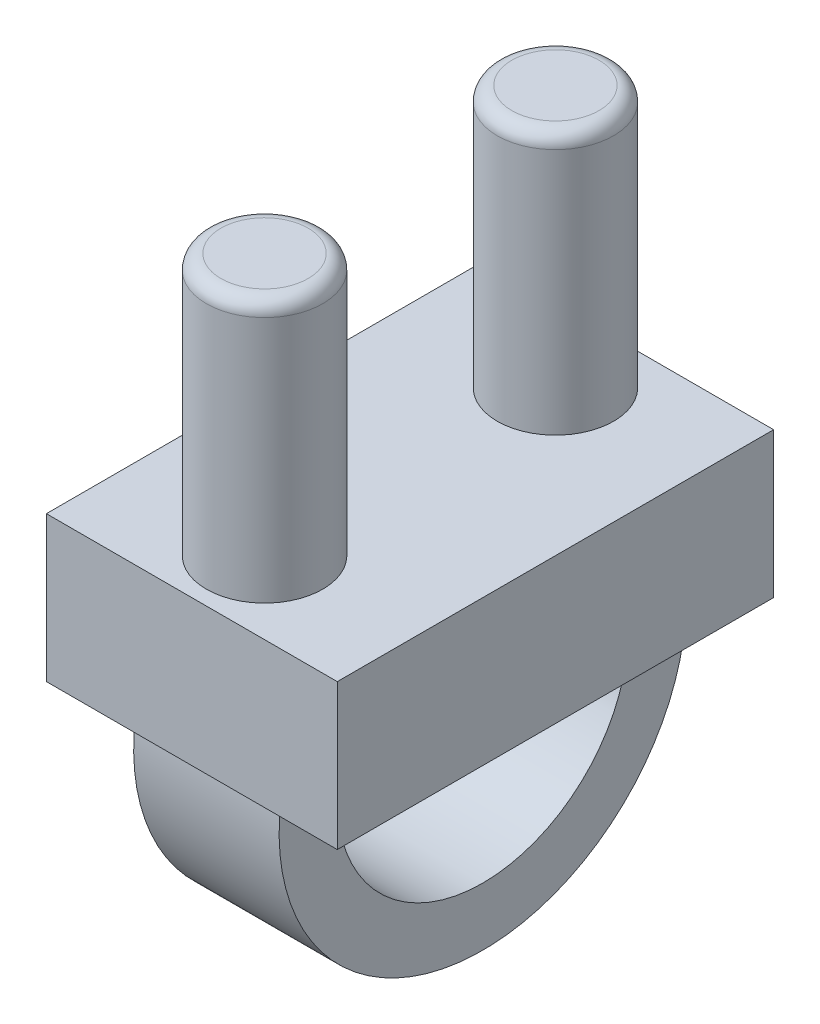
ISO-10303-21;
HEADER;
FILE_DESCRIPTION(('STEP AP214'),'2;1');
FILE_NAME('part.step','',(''),(''),'','','');
FILE_SCHEMA(('AUTOMOTIVE_DESIGN { 1 0 10303 214 1 1 1 1 }'));
ENDSEC;
DATA;
#1=APPLICATION_CONTEXT('core data for automotive mechanical design processes');
#2=APPLICATION_PROTOCOL_DEFINITION('international standard','automotive_design',2000,#1);
#3=PRODUCT_CONTEXT('',#1,'mechanical');
#4=PRODUCT('Part','Part','',(#3));
#5=PRODUCT_RELATED_PRODUCT_CATEGORY('part','',(#4));
#6=PRODUCT_DEFINITION_FORMATION('','',#4);
#7=PRODUCT_DEFINITION_CONTEXT('part definition',#1,'design');
#8=PRODUCT_DEFINITION('design','',#6,#7);
#9=PRODUCT_DEFINITION_SHAPE('','',#8);
#10=(LENGTH_UNIT() NAMED_UNIT(*) SI_UNIT(.MILLI.,.METRE.));
#11=(NAMED_UNIT(*) PLANE_ANGLE_UNIT() SI_UNIT($,.RADIAN.));
#12=(NAMED_UNIT(*) SI_UNIT($,.STERADIAN.) SOLID_ANGLE_UNIT());
#13=UNCERTAINTY_MEASURE_WITH_UNIT(LENGTH_MEASURE(1.E-05),#10,'distance_accuracy_value','');
#14=(GEOMETRIC_REPRESENTATION_CONTEXT(3) GLOBAL_UNCERTAINTY_ASSIGNED_CONTEXT((#13)) GLOBAL_UNIT_ASSIGNED_CONTEXT((#10,
#11,#12)) REPRESENTATION_CONTEXT('',''));
#15=CARTESIAN_POINT('',(0.,0.,0.));
#16=DIRECTION('',(0.,0.,1.));
#17=DIRECTION('',(1.,0.,0.));
#18=AXIS2_PLACEMENT_3D('',#15,#16,#17);
#19=CARTESIAN_POINT('',(1.,1.,-1.5));
#20=DIRECTION('',(-1.,0.,0.));
#21=DIRECTION('',(0.,0.,1.));
#22=AXIS2_PLACEMENT_3D('',#19,#20,#21);
#23=PLANE('',#22);
#24=DIRECTION('',(0.,0.,-1.));
#25=VECTOR('',#24,1.);
#26=CARTESIAN_POINT('',(1.,0.,-1.5));
#27=LINE('',#26,#25);
#28=CARTESIAN_POINT('',(1.,0.,1.5));
#29=VERTEX_POINT('',#28);
#30=CARTESIAN_POINT('',(1.,0.,-1.5));
#31=VERTEX_POINT('',#30);
#32=EDGE_CURVE('E152',#29,#31,#27,.T.);
#33=ORIENTED_EDGE('',*,*,#32,.T.);
#34=DIRECTION('',(0.,-1.,0.));
#35=VECTOR('',#34,1.);
#36=CARTESIAN_POINT('',(1.,1.,-1.5));
#37=LINE('',#36,#35);
#38=CARTESIAN_POINT('',(1.,1.,-1.5));
#39=VERTEX_POINT('',#38);
#40=EDGE_CURVE('E190',#39,#31,#37,.T.);
#41=ORIENTED_EDGE('',*,*,#40,.F.);
#42=DIRECTION('',(0.,0.,-1.));
#43=VECTOR('',#42,1.);
#44=CARTESIAN_POINT('',(1.,1.,-1.5));
#45=LINE('',#44,#43);
#46=CARTESIAN_POINT('',(1.,1.,1.5));
#47=VERTEX_POINT('',#46);
#48=EDGE_CURVE('E153',#47,#39,#45,.T.);
#49=ORIENTED_EDGE('',*,*,#48,.F.);
#50=DIRECTION('',(0.,-1.,0.));
#51=VECTOR('',#50,1.);
#52=CARTESIAN_POINT('',(1.,1.,1.5));
#53=LINE('',#52,#51);
#54=EDGE_CURVE('E167',#47,#29,#53,.T.);
#55=ORIENTED_EDGE('',*,*,#54,.T.);
#56=EDGE_LOOP('',(#33,#41,#49,#55));
#57=FACE_BOUND('',#56,.T.);
#58=ADVANCED_FACE('F40',(#57),#23,.F.);
#59=CARTESIAN_POINT('',(-1.,1.,-1.5));
#60=DIRECTION('',(0.,0.,1.));
#61=DIRECTION('',(1.,0.,0.));
#62=AXIS2_PLACEMENT_3D('',#59,#60,#61);
#63=PLANE('',#62);
#64=DIRECTION('',(-1.,0.,0.));
#65=VECTOR('',#64,1.);
#66=CARTESIAN_POINT('',(-1.,0.,-1.5));
#67=LINE('',#66,#65);
#68=CARTESIAN_POINT('',(-1.,0.,-1.5));
#69=VERTEX_POINT('',#68);
#70=EDGE_CURVE('E171',#31,#69,#67,.T.);
#71=ORIENTED_EDGE('',*,*,#70,.T.);
#72=DIRECTION('',(0.,-1.,0.));
#73=VECTOR('',#72,1.);
#74=CARTESIAN_POINT('',(-1.,1.,-1.5));
#75=LINE('',#74,#73);
#76=CARTESIAN_POINT('',(-1.,1.,-1.5));
#77=VERTEX_POINT('',#76);
#78=EDGE_CURVE('E186',#77,#69,#75,.T.);
#79=ORIENTED_EDGE('',*,*,#78,.F.);
#80=DIRECTION('',(-1.,0.,0.));
#81=VECTOR('',#80,1.);
#82=CARTESIAN_POINT('',(-1.,1.,-1.5));
#83=LINE('',#82,#81);
#84=EDGE_CURVE('E157',#39,#77,#83,.T.);
#85=ORIENTED_EDGE('',*,*,#84,.F.);
#86=ORIENTED_EDGE('',*,*,#40,.T.);
#87=EDGE_LOOP('',(#71,#79,#85,#86));
#88=FACE_BOUND('',#87,.T.);
#89=ADVANCED_FACE('F216',(#88),#63,.F.);
#90=CARTESIAN_POINT('',(-1.,1.,-1.5));
#91=DIRECTION('',(1.,0.,0.));
#92=DIRECTION('',(0.,0.,-1.));
#93=AXIS2_PLACEMENT_3D('',#90,#91,#92);
#94=PLANE('',#93);
#95=DIRECTION('',(0.,0.,1.));
#96=VECTOR('',#95,1.);
#97=CARTESIAN_POINT('',(-1.,0.,-1.5));
#98=LINE('',#97,#96);
#99=CARTESIAN_POINT('',(-1.,0.,1.5));
#100=VERTEX_POINT('',#99);
#101=EDGE_CURVE('E174',#69,#100,#98,.T.);
#102=ORIENTED_EDGE('',*,*,#101,.T.);
#103=DIRECTION('',(0.,-1.,0.));
#104=VECTOR('',#103,1.);
#105=CARTESIAN_POINT('',(-1.,1.,1.5));
#106=LINE('',#105,#104);
#107=CARTESIAN_POINT('',(-1.,1.,1.5));
#108=VERTEX_POINT('',#107);
#109=EDGE_CURVE('E182',#108,#100,#106,.T.);
#110=ORIENTED_EDGE('',*,*,#109,.F.);
#111=DIRECTION('',(0.,0.,1.));
#112=VECTOR('',#111,1.);
#113=CARTESIAN_POINT('',(-1.,1.,-1.5));
#114=LINE('',#113,#112);
#115=EDGE_CURVE('E161',#77,#108,#114,.T.);
#116=ORIENTED_EDGE('',*,*,#115,.F.);
#117=ORIENTED_EDGE('',*,*,#78,.T.);
#118=EDGE_LOOP('',(#102,#110,#116,#117));
#119=FACE_BOUND('',#118,.T.);
#120=ADVANCED_FACE('F222',(#119),#94,.F.);
#121=CARTESIAN_POINT('',(-1.,1.,1.5));
#122=DIRECTION('',(0.,0.,-1.));
#123=DIRECTION('',(-1.,0.,0.));
#124=AXIS2_PLACEMENT_3D('',#121,#122,#123);
#125=PLANE('',#124);
#126=DIRECTION('',(1.,0.,0.));
#127=VECTOR('',#126,1.);
#128=CARTESIAN_POINT('',(-1.,0.,1.5));
#129=LINE('',#128,#127);
#130=EDGE_CURVE('E158',#100,#29,#129,.T.);
#131=ORIENTED_EDGE('',*,*,#130,.T.);
#132=ORIENTED_EDGE('',*,*,#54,.F.);
#133=DIRECTION('',(1.,0.,0.));
#134=VECTOR('',#133,1.);
#135=CARTESIAN_POINT('',(-1.,1.,1.5));
#136=LINE('',#135,#134);
#137=EDGE_CURVE('E164',#108,#47,#136,.T.);
#138=ORIENTED_EDGE('',*,*,#137,.F.);
#139=ORIENTED_EDGE('',*,*,#109,.T.);
#140=EDGE_LOOP('',(#131,#132,#138,#139));
#141=FACE_BOUND('',#140,.T.);
#142=ADVANCED_FACE('F228',(#141),#125,.F.);
#143=CARTESIAN_POINT('',(0.,1.,0.));
#144=DIRECTION('',(0.,1.,0.));
#145=DIRECTION('',(0.,0.,1.));
#146=AXIS2_PLACEMENT_3D('',#143,#144,#145);
#147=PLANE('',#146);
#148=CARTESIAN_POINT('',(0.,1.,1.));
#149=DIRECTION('',(0.,1.,0.));
#150=DIRECTION('',(0.,0.,1.));
#151=AXIS2_PLACEMENT_3D('',#148,#149,#150);
#152=CIRCLE('',#151,0.4);
#153=CARTESIAN_POINT('',(0.,1.,1.4));
#154=VERTEX_POINT('',#153);
#155=EDGE_CURVE('E111',#154,#154,#152,.T.);
#156=ORIENTED_EDGE('',*,*,#155,.F.);
#157=EDGE_LOOP('',(#156));
#158=FACE_BOUND('',#157,.T.);
#159=CARTESIAN_POINT('',(0.,1.,-1.));
#160=DIRECTION('',(0.,1.,0.));
#161=DIRECTION('',(0.,0.,1.));
#162=AXIS2_PLACEMENT_3D('',#159,#160,#161);
#163=CIRCLE('',#162,0.4);
#164=CARTESIAN_POINT('',(0.,1.,-0.6));
#165=VERTEX_POINT('',#164);
#166=EDGE_CURVE('E148',#165,#165,#163,.T.);
#167=ORIENTED_EDGE('',*,*,#166,.F.);
#168=EDGE_LOOP('',(#167));
#169=FACE_BOUND('',#168,.T.);
#170=ORIENTED_EDGE('',*,*,#48,.T.);
#171=ORIENTED_EDGE('',*,*,#84,.T.);
#172=ORIENTED_EDGE('',*,*,#115,.T.);
#173=ORIENTED_EDGE('',*,*,#137,.T.);
#174=EDGE_LOOP('',(#170,#171,#172,#173));
#175=FACE_BOUND('',#174,.T.);
#176=ADVANCED_FACE('F232',(#158,#169,#175),#147,.T.);
#177=CARTESIAN_POINT('',(0.,0.,0.));
#178=DIRECTION('',(0.,1.,0.));
#179=DIRECTION('',(0.,0.,1.));
#180=AXIS2_PLACEMENT_3D('',#177,#178,#179);
#181=PLANE('',#180);
#182=DIRECTION('',(-1.,0.,0.));
#183=VECTOR('',#182,1.);
#184=CARTESIAN_POINT('',(0.5,0.,1.3856406460551));
#185=LINE('',#184,#183);
#186=CARTESIAN_POINT('',(0.5,0.,1.3856406460551));
#187=VERTEX_POINT('',#186);
#188=CARTESIAN_POINT('',(-0.5,0.,1.3856406460551));
#189=VERTEX_POINT('',#188);
#190=EDGE_CURVE('E61',#187,#189,#185,.T.);
#191=ORIENTED_EDGE('',*,*,#190,.F.);
#192=DIRECTION('',(0.,0.,1.));
#193=VECTOR('',#192,1.);
#194=CARTESIAN_POINT('',(0.5,0.,1.3856406460551));
#195=LINE('',#194,#193);
#196=CARTESIAN_POINT('',(0.5,0.,0.979795897113271));
#197=VERTEX_POINT('',#196);
#198=EDGE_CURVE('E56',#197,#187,#195,.T.);
#199=ORIENTED_EDGE('',*,*,#198,.F.);
#200=DIRECTION('',(-1.,0.,0.));
#201=VECTOR('',#200,1.);
#202=CARTESIAN_POINT('',(0.5,0.,0.979795897113271));
#203=LINE('',#202,#201);
#204=CARTESIAN_POINT('',(-0.5,0.,0.979795897113271));
#205=VERTEX_POINT('',#204);
#206=EDGE_CURVE('E102',#197,#205,#203,.T.);
#207=ORIENTED_EDGE('',*,*,#206,.T.);
#208=DIRECTION('',(0.,0.,1.));
#209=VECTOR('',#208,1.);
#210=CARTESIAN_POINT('',(-0.5,0.,1.3856406460551));
#211=LINE('',#210,#209);
#212=EDGE_CURVE('E106',#205,#189,#211,.T.);
#213=ORIENTED_EDGE('',*,*,#212,.T.);
#214=EDGE_LOOP('',(#191,#199,#207,#213));
#215=FACE_BOUND('',#214,.T.);
#216=DIRECTION('',(-1.,0.,0.));
#217=VECTOR('',#216,1.);
#218=CARTESIAN_POINT('',(0.5,0.,-0.979795897113271));
#219=LINE('',#218,#217);
#220=CARTESIAN_POINT('',(0.5,0.,-0.979795897113271));
#221=VERTEX_POINT('',#220);
#222=CARTESIAN_POINT('',(-0.5,0.,-0.979795897113271));
#223=VERTEX_POINT('',#222);
#224=EDGE_CURVE('E125',#221,#223,#219,.T.);
#225=ORIENTED_EDGE('',*,*,#224,.F.);
#226=DIRECTION('',(0.,0.,1.));
#227=VECTOR('',#226,1.);
#228=CARTESIAN_POINT('',(0.5,0.,-0.979795897113271));
#229=LINE('',#228,#227);
#230=CARTESIAN_POINT('',(0.5,0.,-1.3856406460551));
#231=VERTEX_POINT('',#230);
#232=EDGE_CURVE('E129',#231,#221,#229,.T.);
#233=ORIENTED_EDGE('',*,*,#232,.F.);
#234=DIRECTION('',(-1.,0.,0.));
#235=VECTOR('',#234,1.);
#236=CARTESIAN_POINT('',(0.5,0.,-1.3856406460551));
#237=LINE('',#236,#235);
#238=CARTESIAN_POINT('',(-0.5,0.,-1.3856406460551));
#239=VERTEX_POINT('',#238);
#240=EDGE_CURVE('E140',#231,#239,#237,.T.);
#241=ORIENTED_EDGE('',*,*,#240,.T.);
#242=DIRECTION('',(0.,0.,1.));
#243=VECTOR('',#242,1.);
#244=CARTESIAN_POINT('',(-0.5,0.,-0.979795897113271));
#245=LINE('',#244,#243);
#246=EDGE_CURVE('E134',#239,#223,#245,.T.);
#247=ORIENTED_EDGE('',*,*,#246,.T.);
#248=EDGE_LOOP('',(#225,#233,#241,#247));
#249=FACE_BOUND('',#248,.T.);
#250=ORIENTED_EDGE('',*,*,#32,.F.);
#251=ORIENTED_EDGE('',*,*,#130,.F.);
#252=ORIENTED_EDGE('',*,*,#101,.F.);
#253=ORIENTED_EDGE('',*,*,#70,.F.);
#254=EDGE_LOOP('',(#250,#251,#252,#253));
#255=FACE_BOUND('',#254,.T.);
#256=ADVANCED_FACE('F104',(#215,#249,#255),#181,.F.);
#257=CARTESIAN_POINT('',(0.,2.8,-1.));
#258=DIRECTION('',(0.,-1.,0.));
#259=DIRECTION('',(0.,0.,-1.));
#260=AXIS2_PLACEMENT_3D('',#257,#258,#259);
#261=CYLINDRICAL_SURFACE('',#260,0.4);
#262=CARTESIAN_POINT('',(0.,2.7,-1.));
#263=DIRECTION('',(0.,1.,0.));
#264=DIRECTION('',(0.,0.,1.));
#265=AXIS2_PLACEMENT_3D('',#262,#263,#264);
#266=CIRCLE('',#265,0.4);
#267=CARTESIAN_POINT('',(0.,2.7,-0.6));
#268=VERTEX_POINT('',#267);
#269=EDGE_CURVE('E11',#268,#268,#266,.F.);
#270=ORIENTED_EDGE('',*,*,#269,.T.);
#271=EDGE_LOOP('',(#270));
#272=FACE_BOUND('',#271,.T.);
#273=ORIENTED_EDGE('',*,*,#166,.T.);
#274=EDGE_LOOP('',(#273));
#275=FACE_BOUND('',#274,.T.);
#276=ADVANCED_FACE('F236',(#272,#275),#261,.T.);
#277=CARTESIAN_POINT('',(0.,2.8,-1.));
#278=DIRECTION('',(0.,1.,0.));
#279=DIRECTION('',(0.,0.,1.));
#280=AXIS2_PLACEMENT_3D('',#277,#278,#279);
#281=PLANE('',#280);
#282=CARTESIAN_POINT('',(0.,2.8,-1.));
#283=DIRECTION('',(0.,1.,0.));
#284=DIRECTION('',(0.,0.,1.));
#285=AXIS2_PLACEMENT_3D('',#282,#283,#284);
#286=CIRCLE('',#285,0.3);
#287=CARTESIAN_POINT('',(0.,2.8,-0.7));
#288=VERTEX_POINT('',#287);
#289=EDGE_CURVE('E49',#288,#288,#286,.T.);
#290=ORIENTED_EDGE('',*,*,#289,.T.);
#291=EDGE_LOOP('',(#290));
#292=FACE_BOUND('',#291,.T.);
#293=ADVANCED_FACE('F205',(#292),#281,.T.);
#294=CARTESIAN_POINT('',(0.,2.8,1.));
#295=DIRECTION('',(0.,-1.,0.));
#296=DIRECTION('',(0.,0.,-1.));
#297=AXIS2_PLACEMENT_3D('',#294,#295,#296);
#298=CYLINDRICAL_SURFACE('',#297,0.4);
#299=CARTESIAN_POINT('',(0.,2.7,1.));
#300=DIRECTION('',(0.,1.,0.));
#301=DIRECTION('',(0.,0.,1.));
#302=AXIS2_PLACEMENT_3D('',#299,#300,#301);
#303=CIRCLE('',#302,0.4);
#304=CARTESIAN_POINT('',(0.,2.7,1.4));
#305=VERTEX_POINT('',#304);
#306=EDGE_CURVE('E198',#305,#305,#303,.F.);
#307=ORIENTED_EDGE('',*,*,#306,.T.);
#308=EDGE_LOOP('',(#307));
#309=FACE_BOUND('',#308,.T.);
#310=ORIENTED_EDGE('',*,*,#155,.T.);
#311=EDGE_LOOP('',(#310));
#312=FACE_BOUND('',#311,.T.);
#313=ADVANCED_FACE('F245',(#309,#312),#298,.T.);
#314=CARTESIAN_POINT('',(0.,2.8,1.));
#315=DIRECTION('',(0.,1.,0.));
#316=DIRECTION('',(0.,0.,1.));
#317=AXIS2_PLACEMENT_3D('',#314,#315,#316);
#318=PLANE('',#317);
#319=CARTESIAN_POINT('',(0.,2.8,1.));
#320=DIRECTION('',(0.,1.,0.));
#321=DIRECTION('',(0.,0.,1.));
#322=AXIS2_PLACEMENT_3D('',#319,#320,#321);
#323=CIRCLE('',#322,0.3);
#324=CARTESIAN_POINT('',(0.,2.8,1.3));
#325=VERTEX_POINT('',#324);
#326=EDGE_CURVE('E194',#325,#325,#323,.T.);
#327=ORIENTED_EDGE('',*,*,#326,.T.);
#328=EDGE_LOOP('',(#327));
#329=FACE_BOUND('',#328,.T.);
#330=ADVANCED_FACE('F248',(#329),#318,.T.);
#331=CARTESIAN_POINT('',(0.5,-0.2,0.));
#332=DIRECTION('',(-1.,0.,0.));
#333=DIRECTION('',(0.,0.,1.));
#334=AXIS2_PLACEMENT_3D('',#331,#332,#333);
#335=CYLINDRICAL_SURFACE('',#334,1.);
#336=CARTESIAN_POINT('',(-0.5,-0.2,0.));
#337=DIRECTION('',(-1.,0.,0.));
#338=DIRECTION('',(0.,0.,-1.));
#339=AXIS2_PLACEMENT_3D('',#336,#337,#338);
#340=CIRCLE('',#339,1.);
#341=EDGE_CURVE('E118',#223,#205,#340,.T.);
#342=ORIENTED_EDGE('',*,*,#341,.T.);
#343=ORIENTED_EDGE('',*,*,#206,.F.);
#344=CARTESIAN_POINT('',(0.5,-0.2,0.));
#345=DIRECTION('',(-1.,0.,0.));
#346=DIRECTION('',(0.,0.,-1.));
#347=AXIS2_PLACEMENT_3D('',#344,#345,#346);
#348=CIRCLE('',#347,1.);
#349=EDGE_CURVE('E137',#221,#197,#348,.T.);
#350=ORIENTED_EDGE('',*,*,#349,.F.);
#351=ORIENTED_EDGE('',*,*,#224,.T.);
#352=EDGE_LOOP('',(#342,#343,#350,#351));
#353=FACE_BOUND('',#352,.T.);
#354=ADVANCED_FACE('F124',(#353),#335,.F.);
#355=CARTESIAN_POINT('',(0.5,-0.2,0.));
#356=DIRECTION('',(-1.,0.,0.));
#357=DIRECTION('',(0.,0.,1.));
#358=AXIS2_PLACEMENT_3D('',#355,#356,#357);
#359=CYLINDRICAL_SURFACE('',#358,1.4);
#360=CARTESIAN_POINT('',(-0.5,-0.2,0.));
#361=DIRECTION('',(1.,0.,0.));
#362=DIRECTION('',(0.,0.,-1.));
#363=AXIS2_PLACEMENT_3D('',#360,#361,#362);
#364=CIRCLE('',#363,1.4);
#365=EDGE_CURVE('E120',#189,#239,#364,.T.);
#366=ORIENTED_EDGE('',*,*,#365,.T.);
#367=ORIENTED_EDGE('',*,*,#240,.F.);
#368=CARTESIAN_POINT('',(0.5,-0.2,0.));
#369=DIRECTION('',(1.,0.,0.));
#370=DIRECTION('',(0.,0.,-1.));
#371=AXIS2_PLACEMENT_3D('',#368,#369,#370);
#372=CIRCLE('',#371,1.4);
#373=EDGE_CURVE('E272',#187,#231,#372,.T.);
#374=ORIENTED_EDGE('',*,*,#373,.F.);
#375=ORIENTED_EDGE('',*,*,#190,.T.);
#376=EDGE_LOOP('',(#366,#367,#374,#375));
#377=FACE_BOUND('',#376,.T.);
#378=ADVANCED_FACE('F255',(#377),#359,.T.);
#379=CARTESIAN_POINT('',(0.5,-0.2,0.));
#380=DIRECTION('',(1.,0.,0.));
#381=DIRECTION('',(0.,0.,-1.));
#382=AXIS2_PLACEMENT_3D('',#379,#380,#381);
#383=PLANE('',#382);
#384=ORIENTED_EDGE('',*,*,#349,.T.);
#385=ORIENTED_EDGE('',*,*,#198,.T.);
#386=ORIENTED_EDGE('',*,*,#373,.T.);
#387=ORIENTED_EDGE('',*,*,#232,.T.);
#388=EDGE_LOOP('',(#384,#385,#386,#387));
#389=FACE_BOUND('',#388,.T.);
#390=ADVANCED_FACE('F258',(#389),#383,.T.);
#391=CARTESIAN_POINT('',(-0.5,-0.2,0.));
#392=DIRECTION('',(1.,0.,0.));
#393=DIRECTION('',(0.,0.,-1.));
#394=AXIS2_PLACEMENT_3D('',#391,#392,#393);
#395=PLANE('',#394);
#396=ORIENTED_EDGE('',*,*,#341,.F.);
#397=ORIENTED_EDGE('',*,*,#246,.F.);
#398=ORIENTED_EDGE('',*,*,#365,.F.);
#399=ORIENTED_EDGE('',*,*,#212,.F.);
#400=EDGE_LOOP('',(#396,#397,#398,#399));
#401=FACE_BOUND('',#400,.T.);
#402=ADVANCED_FACE('F116',(#401),#395,.F.);
#403=CARTESIAN_POINT('',(0.,2.7,1.));
#404=DIRECTION('',(0.,1.,0.));
#405=DIRECTION('',(0.,0.,1.));
#406=AXIS2_PLACEMENT_3D('',#403,#404,#405);
#407=TOROIDAL_SURFACE('',#406,0.3,0.1);
#408=ORIENTED_EDGE('',*,*,#306,.F.);
#409=EDGE_LOOP('',(#408));
#410=FACE_BOUND('',#409,.T.);
#411=ORIENTED_EDGE('',*,*,#326,.F.);
#412=EDGE_LOOP('',(#411));
#413=FACE_BOUND('',#412,.T.);
#414=ADVANCED_FACE('F208',(#410,#413),#407,.T.);
#415=CARTESIAN_POINT('',(0.,2.7,-1.));
#416=DIRECTION('',(0.,1.,0.));
#417=DIRECTION('',(0.,0.,1.));
#418=AXIS2_PLACEMENT_3D('',#415,#416,#417);
#419=TOROIDAL_SURFACE('',#418,0.3,0.1);
#420=ORIENTED_EDGE('',*,*,#269,.F.);
#421=EDGE_LOOP('',(#420));
#422=FACE_BOUND('',#421,.T.);
#423=ORIENTED_EDGE('',*,*,#289,.F.);
#424=EDGE_LOOP('',(#423));
#425=FACE_BOUND('',#424,.T.);
#426=ADVANCED_FACE('F42',(#422,#425),#419,.T.);
#427=CLOSED_SHELL('',(#58,#89,#120,#142,#176,#256,#276,#293,#313,#330,#354,#378,#390,#402,#414,#426));
#428=MANIFOLD_SOLID_BREP('B2',#427);
#429=ADVANCED_BREP_SHAPE_REPRESENTATION('',(#18,#428),#14);
#430=SHAPE_DEFINITION_REPRESENTATION(#9,#429);
ENDSEC;
END-ISO-10303-21;
